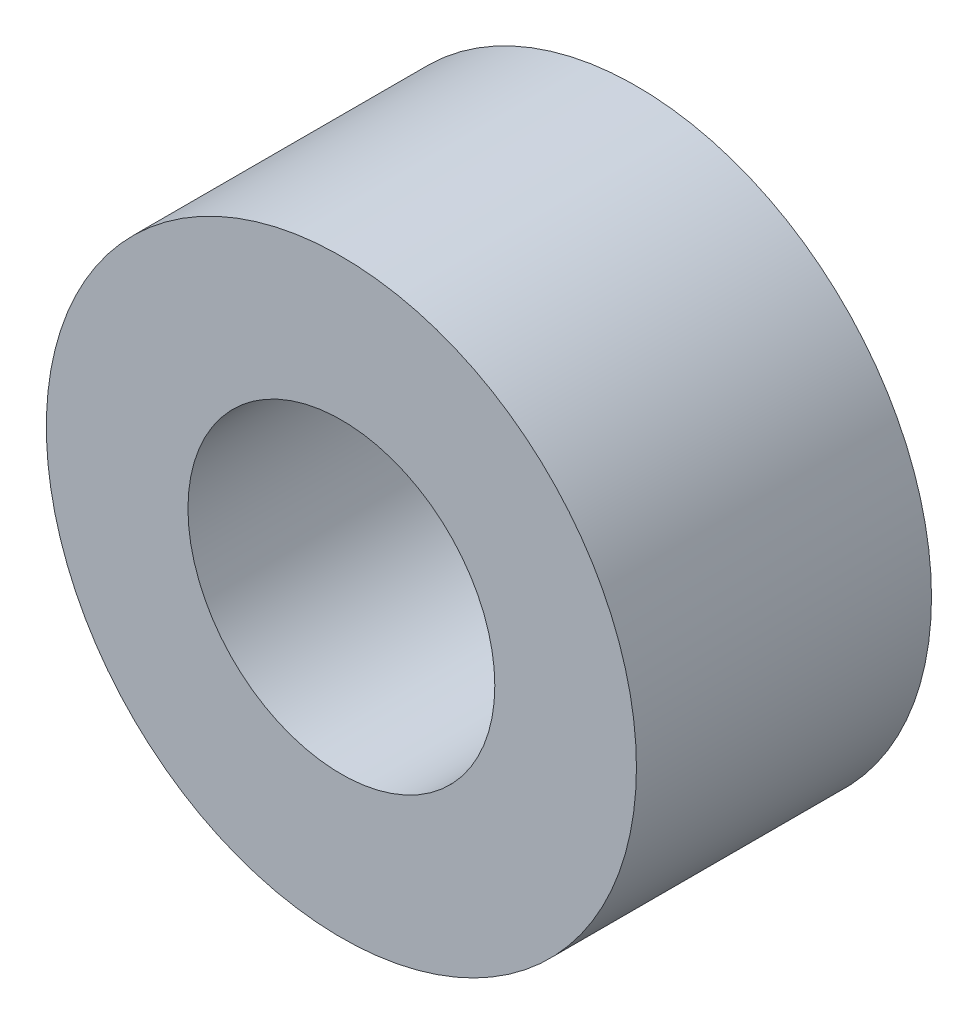
ISO-10303-21;
HEADER;
FILE_DESCRIPTION(('STEP AP214'),'2;1');
FILE_NAME('part.step','',(''),(''),'','','');
FILE_SCHEMA(('AUTOMOTIVE_DESIGN { 1 0 10303 214 1 1 1 1 }'));
ENDSEC;
DATA;
#1=APPLICATION_CONTEXT('core data for automotive mechanical design processes');
#2=APPLICATION_PROTOCOL_DEFINITION('international standard','automotive_design',2000,#1);
#3=PRODUCT_CONTEXT('',#1,'mechanical');
#4=PRODUCT('Part','Part','',(#3));
#5=PRODUCT_RELATED_PRODUCT_CATEGORY('part','',(#4));
#6=PRODUCT_DEFINITION_FORMATION('','',#4);
#7=PRODUCT_DEFINITION_CONTEXT('part definition',#1,'design');
#8=PRODUCT_DEFINITION('design','',#6,#7);
#9=PRODUCT_DEFINITION_SHAPE('','',#8);
#10=(LENGTH_UNIT() NAMED_UNIT(*) SI_UNIT(.MILLI.,.METRE.));
#11=(NAMED_UNIT(*) PLANE_ANGLE_UNIT() SI_UNIT($,.RADIAN.));
#12=(NAMED_UNIT(*) SI_UNIT($,.STERADIAN.) SOLID_ANGLE_UNIT());
#13=UNCERTAINTY_MEASURE_WITH_UNIT(LENGTH_MEASURE(1.E-05),#10,'distance_accuracy_value','');
#14=(GEOMETRIC_REPRESENTATION_CONTEXT(3) GLOBAL_UNCERTAINTY_ASSIGNED_CONTEXT((#13)) GLOBAL_UNIT_ASSIGNED_CONTEXT((#10,
#11,#12)) REPRESENTATION_CONTEXT('',''));
#15=CARTESIAN_POINT('',(0.,0.,0.));
#16=DIRECTION('',(0.,0.,1.));
#17=DIRECTION('',(1.,0.,0.));
#18=AXIS2_PLACEMENT_3D('',#15,#16,#17);
#19=CARTESIAN_POINT('',(0.,0.,6.35));
#20=DIRECTION('',(0.,0.,-1.));
#21=DIRECTION('',(-1.,0.,0.));
#22=AXIS2_PLACEMENT_3D('',#19,#20,#21);
#23=CYLINDRICAL_SURFACE('',#22,6.35);
#24=CARTESIAN_POINT('',(0.,0.,6.35));
#25=DIRECTION('',(0.,0.,1.));
#26=DIRECTION('',(1.,0.,0.));
#27=AXIS2_PLACEMENT_3D('',#24,#25,#26);
#28=CIRCLE('',#27,6.35);
#29=CARTESIAN_POINT('',(6.35,0.,6.35));
#30=VERTEX_POINT('',#29);
#31=EDGE_CURVE('E10',#30,#30,#28,.T.);
#32=ORIENTED_EDGE('',*,*,#31,.F.);
#33=EDGE_LOOP('',(#32));
#34=FACE_BOUND('',#33,.T.);
#35=CARTESIAN_POINT('',(0.,0.,0.));
#36=DIRECTION('',(0.,0.,1.));
#37=DIRECTION('',(1.,0.,0.));
#38=AXIS2_PLACEMENT_3D('',#35,#36,#37);
#39=CIRCLE('',#38,6.35);
#40=CARTESIAN_POINT('',(6.35,0.,0.));
#41=VERTEX_POINT('',#40);
#42=EDGE_CURVE('E37',#41,#41,#39,.T.);
#43=ORIENTED_EDGE('',*,*,#42,.T.);
#44=EDGE_LOOP('',(#43));
#45=FACE_BOUND('',#44,.T.);
#46=ADVANCED_FACE('F34',(#34,#45),#23,.T.);
#47=CARTESIAN_POINT('',(0.,0.,6.35));
#48=DIRECTION('',(0.,0.,1.));
#49=DIRECTION('',(1.,0.,0.));
#50=AXIS2_PLACEMENT_3D('',#47,#48,#49);
#51=PLANE('',#50);
#52=CARTESIAN_POINT('',(0.,0.,6.35));
#53=DIRECTION('',(0.,0.,1.));
#54=DIRECTION('',(1.,0.,0.));
#55=AXIS2_PLACEMENT_3D('',#52,#53,#54);
#56=CIRCLE('',#55,3.302);
#57=CARTESIAN_POINT('',(3.302,0.,6.35));
#58=VERTEX_POINT('',#57);
#59=EDGE_CURVE('E46',#58,#58,#56,.T.);
#60=ORIENTED_EDGE('',*,*,#59,.F.);
#61=EDGE_LOOP('',(#60));
#62=FACE_BOUND('',#61,.T.);
#63=ORIENTED_EDGE('',*,*,#31,.T.);
#64=EDGE_LOOP('',(#63));
#65=FACE_BOUND('',#64,.T.);
#66=ADVANCED_FACE('F61',(#62,#65),#51,.T.);
#67=CARTESIAN_POINT('',(0.,0.,0.));
#68=DIRECTION('',(0.,0.,1.));
#69=DIRECTION('',(1.,0.,0.));
#70=AXIS2_PLACEMENT_3D('',#67,#68,#69);
#71=PLANE('',#70);
#72=CARTESIAN_POINT('',(0.,0.,0.));
#73=DIRECTION('',(0.,0.,1.));
#74=DIRECTION('',(1.,0.,0.));
#75=AXIS2_PLACEMENT_3D('',#72,#73,#74);
#76=CIRCLE('',#75,3.302);
#77=CARTESIAN_POINT('',(3.302,0.,0.));
#78=VERTEX_POINT('',#77);
#79=EDGE_CURVE('E44',#78,#78,#76,.T.);
#80=ORIENTED_EDGE('',*,*,#79,.T.);
#81=EDGE_LOOP('',(#80));
#82=FACE_BOUND('',#81,.T.);
#83=ORIENTED_EDGE('',*,*,#42,.F.);
#84=EDGE_LOOP('',(#83));
#85=FACE_BOUND('',#84,.T.);
#86=ADVANCED_FACE('F52',(#82,#85),#71,.F.);
#87=CARTESIAN_POINT('',(0.,0.,0.));
#88=DIRECTION('',(0.,0.,1.));
#89=DIRECTION('',(1.,0.,0.));
#90=AXIS2_PLACEMENT_3D('',#87,#88,#89);
#91=CYLINDRICAL_SURFACE('',#90,3.302);
#92=ORIENTED_EDGE('',*,*,#79,.F.);
#93=EDGE_LOOP('',(#92));
#94=FACE_BOUND('',#93,.T.);
#95=ORIENTED_EDGE('',*,*,#59,.T.);
#96=EDGE_LOOP('',(#95));
#97=FACE_BOUND('',#96,.T.);
#98=ADVANCED_FACE('F55',(#94,#97),#91,.F.);
#99=CLOSED_SHELL('',(#46,#66,#86,#98));
#100=MANIFOLD_SOLID_BREP('B2',#99);
#101=ADVANCED_BREP_SHAPE_REPRESENTATION('',(#18,#100),#14);
#102=SHAPE_DEFINITION_REPRESENTATION(#9,#101);
ENDSEC;
END-ISO-10303-21;
